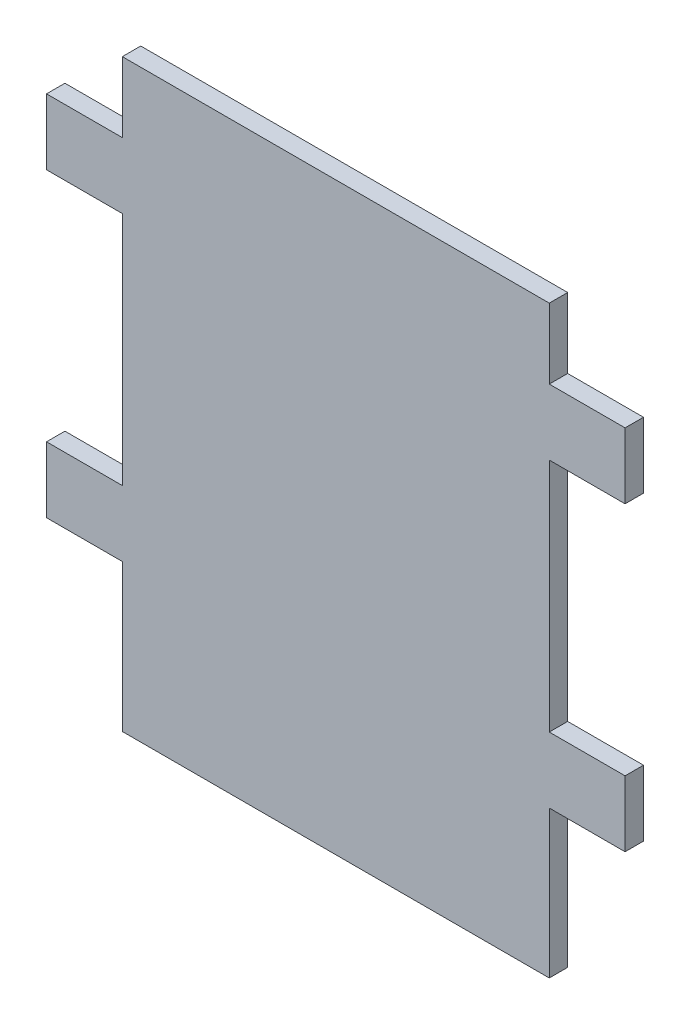
ISO-10303-21;
HEADER;
FILE_DESCRIPTION(('STEP AP214'),'2;1');
FILE_NAME('part.step','',(''),(''),'','','');
FILE_SCHEMA(('AUTOMOTIVE_DESIGN { 1 0 10303 214 1 1 1 1 }'));
ENDSEC;
DATA;
#1=APPLICATION_CONTEXT('core data for automotive mechanical design processes');
#2=APPLICATION_PROTOCOL_DEFINITION('international standard','automotive_design',2000,#1);
#3=PRODUCT_CONTEXT('',#1,'mechanical');
#4=PRODUCT('Part','Part','',(#3));
#5=PRODUCT_RELATED_PRODUCT_CATEGORY('part','',(#4));
#6=PRODUCT_DEFINITION_FORMATION('','',#4);
#7=PRODUCT_DEFINITION_CONTEXT('part definition',#1,'design');
#8=PRODUCT_DEFINITION('design','',#6,#7);
#9=PRODUCT_DEFINITION_SHAPE('','',#8);
#10=(LENGTH_UNIT() NAMED_UNIT(*) SI_UNIT(.MILLI.,.METRE.));
#11=(NAMED_UNIT(*) PLANE_ANGLE_UNIT() SI_UNIT($,.RADIAN.));
#12=(NAMED_UNIT(*) SI_UNIT($,.STERADIAN.) SOLID_ANGLE_UNIT());
#13=UNCERTAINTY_MEASURE_WITH_UNIT(LENGTH_MEASURE(1.E-05),#10,'distance_accuracy_value','');
#14=(GEOMETRIC_REPRESENTATION_CONTEXT(3) GLOBAL_UNCERTAINTY_ASSIGNED_CONTEXT((#13)) GLOBAL_UNIT_ASSIGNED_CONTEXT((#10,
#11,#12)) REPRESENTATION_CONTEXT('',''));
#15=CARTESIAN_POINT('',(0.,0.,0.));
#16=DIRECTION('',(0.,0.,1.));
#17=DIRECTION('',(1.,0.,0.));
#18=AXIS2_PLACEMENT_3D('',#15,#16,#17);
#19=CARTESIAN_POINT('',(-48.6695817036597,65.3946510951075,3.175));
#20=DIRECTION('',(1.,0.,0.));
#21=DIRECTION('',(0.,1.,0.));
#22=AXIS2_PLACEMENT_3D('',#19,#20,#21);
#23=PLANE('',#22);
#24=DIRECTION('',(0.,-1.,0.));
#25=VECTOR('',#24,1.);
#26=CARTESIAN_POINT('',(-48.6695817036597,65.3946510951075,0.));
#27=LINE('',#26,#25);
#28=CARTESIAN_POINT('',(-48.6695817036597,53.2946498951075,0.));
#29=VERTEX_POINT('',#28);
#30=CARTESIAN_POINT('',(-48.6695817036597,41.9446598951075,0.));
#31=VERTEX_POINT('',#30);
#32=EDGE_CURVE('E192',#29,#31,#27,.T.);
#33=ORIENTED_EDGE('',*,*,#32,.T.);
#34=DIRECTION('',(0.,0.,1.));
#35=VECTOR('',#34,1.);
#36=CARTESIAN_POINT('',(-48.6695817036597,41.9446598951075,0.));
#37=LINE('',#36,#35);
#38=CARTESIAN_POINT('',(-48.6695817036597,41.9446598951075,3.175));
#39=VERTEX_POINT('',#38);
#40=EDGE_CURVE('E287',#31,#39,#37,.T.);
#41=ORIENTED_EDGE('',*,*,#40,.T.);
#42=DIRECTION('',(0.,-1.,0.));
#43=VECTOR('',#42,1.);
#44=CARTESIAN_POINT('',(-48.6695817036597,65.3946510951075,3.175));
#45=LINE('',#44,#43);
#46=CARTESIAN_POINT('',(-48.6695817036597,53.2946498951075,3.175));
#47=VERTEX_POINT('',#46);
#48=EDGE_CURVE('E219',#47,#39,#45,.T.);
#49=ORIENTED_EDGE('',*,*,#48,.F.);
#50=DIRECTION('',(0.,0.,1.));
#51=VECTOR('',#50,1.);
#52=CARTESIAN_POINT('',(-48.6695817036597,53.2946498951075,0.));
#53=LINE('',#52,#51);
#54=EDGE_CURVE('E227',#29,#47,#53,.T.);
#55=ORIENTED_EDGE('',*,*,#54,.F.);
#56=EDGE_LOOP('',(#33,#41,#49,#55));
#57=FACE_BOUND('',#56,.T.);
#58=ADVANCED_FACE('F33',(#57),#23,.F.);
#59=CARTESIAN_POINT('',(51.1504370963403,65.3946510951075,3.175));
#60=DIRECTION('',(-1.,0.,0.));
#61=DIRECTION('',(0.,-1.,0.));
#62=AXIS2_PLACEMENT_3D('',#59,#60,#61);
#63=PLANE('',#62);
#64=DIRECTION('',(0.,1.,0.));
#65=VECTOR('',#64,1.);
#66=CARTESIAN_POINT('',(51.1504370963403,65.3946510951075,0.));
#67=LINE('',#66,#65);
#68=CARTESIAN_POINT('',(51.1504370963403,41.9446598951075,0.));
#69=VERTEX_POINT('',#68);
#70=CARTESIAN_POINT('',(51.1504370963403,53.2946498951075,0.));
#71=VERTEX_POINT('',#70);
#72=EDGE_CURVE('E203',#69,#71,#67,.T.);
#73=ORIENTED_EDGE('',*,*,#72,.T.);
#74=DIRECTION('',(0.,0.,1.));
#75=VECTOR('',#74,1.);
#76=CARTESIAN_POINT('',(51.1504370963403,53.2946498951075,0.));
#77=LINE('',#76,#75);
#78=CARTESIAN_POINT('',(51.1504370963403,53.2946498951075,3.175));
#79=VERTEX_POINT('',#78);
#80=EDGE_CURVE('E339',#71,#79,#77,.T.);
#81=ORIENTED_EDGE('',*,*,#80,.T.);
#82=DIRECTION('',(0.,1.,0.));
#83=VECTOR('',#82,1.);
#84=CARTESIAN_POINT('',(51.1504370963403,65.3946510951075,3.175));
#85=LINE('',#84,#83);
#86=CARTESIAN_POINT('',(51.1504370963403,41.9446598951075,3.175));
#87=VERTEX_POINT('',#86);
#88=EDGE_CURVE('E230',#87,#79,#85,.T.);
#89=ORIENTED_EDGE('',*,*,#88,.F.);
#90=DIRECTION('',(0.,0.,1.));
#91=VECTOR('',#90,1.);
#92=CARTESIAN_POINT('',(51.1504370963403,41.9446598951075,0.));
#93=LINE('',#92,#91);
#94=EDGE_CURVE('E252',#69,#87,#93,.T.);
#95=ORIENTED_EDGE('',*,*,#94,.F.);
#96=EDGE_LOOP('',(#73,#81,#89,#95));
#97=FACE_BOUND('',#96,.T.);
#98=ADVANCED_FACE('F359',(#97),#63,.F.);
#99=CARTESIAN_POINT('',(-48.6695817036596,1.30465989510754,3.175));
#100=VERTEX_POINT('',#99);
#101=CARTESIAN_POINT('',(-48.6695817036597,-10.0453301048925,3.175));
#102=VERTEX_POINT('',#101);
#103=EDGE_CURVE('E187',#100,#102,#45,.T.);
#104=ORIENTED_EDGE('',*,*,#103,.F.);
#105=DIRECTION('',(0.,0.,1.));
#106=VECTOR('',#105,1.);
#107=CARTESIAN_POINT('',(-48.6695817036596,1.30465989510754,0.));
#108=LINE('',#107,#106);
#109=CARTESIAN_POINT('',(-48.6695817036596,1.30465989510754,0.));
#110=VERTEX_POINT('',#109);
#111=EDGE_CURVE('E174',#110,#100,#108,.T.);
#112=ORIENTED_EDGE('',*,*,#111,.F.);
#113=CARTESIAN_POINT('',(-48.6695817036597,-10.0453301048925,0.));
#114=VERTEX_POINT('',#113);
#115=EDGE_CURVE('E185',#110,#114,#27,.T.);
#116=ORIENTED_EDGE('',*,*,#115,.T.);
#117=DIRECTION('',(0.,0.,1.));
#118=VECTOR('',#117,1.);
#119=CARTESIAN_POINT('',(-48.6695817036597,-10.0453301048925,0.));
#120=LINE('',#119,#118);
#121=EDGE_CURVE('E320',#114,#102,#120,.T.);
#122=ORIENTED_EDGE('',*,*,#121,.T.);
#123=EDGE_LOOP('',(#104,#112,#116,#122));
#124=FACE_BOUND('',#123,.T.);
#125=ADVANCED_FACE('F35',(#124),#23,.F.);
#126=CARTESIAN_POINT('',(-48.6695817036596,-35.4453301048925,3.175));
#127=DIRECTION('',(0.,1.,0.));
#128=DIRECTION('',(0.,0.,1.));
#129=AXIS2_PLACEMENT_3D('',#126,#127,#128);
#130=PLANE('',#129);
#131=DIRECTION('',(1.,0.,0.));
#132=VECTOR('',#131,1.);
#133=CARTESIAN_POINT('',(-48.6695817036596,-35.4453301048925,3.175));
#134=LINE('',#133,#132);
#135=CARTESIAN_POINT('',(-35.5895723036597,-35.4453301048925,3.175));
#136=VERTEX_POINT('',#135);
#137=CARTESIAN_POINT('',(38.0704276963403,-35.4453301048925,3.175));
#138=VERTEX_POINT('',#137);
#139=EDGE_CURVE('E224',#136,#138,#134,.T.);
#140=ORIENTED_EDGE('',*,*,#139,.F.);
#141=DIRECTION('',(0.,0.,1.));
#142=VECTOR('',#141,1.);
#143=CARTESIAN_POINT('',(-35.5895723036597,-35.4453301048925,0.));
#144=LINE('',#143,#142);
#145=CARTESIAN_POINT('',(-35.5895723036597,-35.4453301048925,0.));
#146=VERTEX_POINT('',#145);
#147=EDGE_CURVE('E314',#146,#136,#144,.T.);
#148=ORIENTED_EDGE('',*,*,#147,.F.);
#149=DIRECTION('',(1.,0.,0.));
#150=VECTOR('',#149,1.);
#151=CARTESIAN_POINT('',(-48.6695817036596,-35.4453301048925,0.));
#152=LINE('',#151,#150);
#153=CARTESIAN_POINT('',(38.0704276963403,-35.4453301048925,0.));
#154=VERTEX_POINT('',#153);
#155=EDGE_CURVE('E196',#146,#154,#152,.T.);
#156=ORIENTED_EDGE('',*,*,#155,.T.);
#157=DIRECTION('',(0.,0.,1.));
#158=VECTOR('',#157,1.);
#159=CARTESIAN_POINT('',(38.0704276963403,-35.4453301048925,0.));
#160=LINE('',#159,#158);
#161=EDGE_CURVE('E267',#154,#138,#160,.T.);
#162=ORIENTED_EDGE('',*,*,#161,.T.);
#163=EDGE_LOOP('',(#140,#148,#156,#162));
#164=FACE_BOUND('',#163,.T.);
#165=ADVANCED_FACE('F392',(#164),#130,.F.);
#166=CARTESIAN_POINT('',(51.1504370963403,-10.0453301048925,0.));
#167=VERTEX_POINT('',#166);
#168=CARTESIAN_POINT('',(51.1504370963403,1.30465989510757,0.));
#169=VERTEX_POINT('',#168);
#170=EDGE_CURVE('E205',#167,#169,#67,.T.);
#171=ORIENTED_EDGE('',*,*,#170,.T.);
#172=DIRECTION('',(0.,0.,1.));
#173=VECTOR('',#172,1.);
#174=CARTESIAN_POINT('',(51.1504370963404,1.30465989510754,0.));
#175=LINE('',#174,#173);
#176=CARTESIAN_POINT('',(51.1504370963404,1.30465989510754,3.175));
#177=VERTEX_POINT('',#176);
#178=EDGE_CURVE('E248',#169,#177,#175,.T.);
#179=ORIENTED_EDGE('',*,*,#178,.T.);
#180=CARTESIAN_POINT('',(51.1504370963403,-10.0453301048925,3.175));
#181=VERTEX_POINT('',#180);
#182=EDGE_CURVE('E42',#181,#177,#85,.T.);
#183=ORIENTED_EDGE('',*,*,#182,.F.);
#184=DIRECTION('',(0.,0.,1.));
#185=VECTOR('',#184,1.);
#186=CARTESIAN_POINT('',(51.1504370963403,-10.0453301048925,0.));
#187=LINE('',#186,#185);
#188=EDGE_CURVE('E247',#167,#181,#187,.T.);
#189=ORIENTED_EDGE('',*,*,#188,.F.);
#190=EDGE_LOOP('',(#171,#179,#183,#189));
#191=FACE_BOUND('',#190,.T.);
#192=ADVANCED_FACE('F246',(#191),#63,.F.);
#193=CARTESIAN_POINT('',(-48.6695817036597,65.3946510951075,3.175));
#194=DIRECTION('',(0.,-1.,0.));
#195=DIRECTION('',(0.,0.,-1.));
#196=AXIS2_PLACEMENT_3D('',#193,#194,#195);
#197=PLANE('',#196);
#198=DIRECTION('',(-1.,0.,0.));
#199=VECTOR('',#198,1.);
#200=CARTESIAN_POINT('',(-48.6695817036597,65.3946510951075,3.175));
#201=LINE('',#200,#199);
#202=CARTESIAN_POINT('',(38.0704276963403,65.3946510951075,3.175));
#203=VERTEX_POINT('',#202);
#204=CARTESIAN_POINT('',(-35.5895723036597,65.3946510951075,3.175));
#205=VERTEX_POINT('',#204);
#206=EDGE_CURVE('E11',#203,#205,#201,.T.);
#207=ORIENTED_EDGE('',*,*,#206,.F.);
#208=DIRECTION('',(0.,0.,1.));
#209=VECTOR('',#208,1.);
#210=CARTESIAN_POINT('',(38.0704276963403,65.3946510951075,0.));
#211=LINE('',#210,#209);
#212=CARTESIAN_POINT('',(38.0704276963403,65.3946510951075,0.));
#213=VERTEX_POINT('',#212);
#214=EDGE_CURVE('E318',#213,#203,#211,.T.);
#215=ORIENTED_EDGE('',*,*,#214,.F.);
#216=DIRECTION('',(-1.,0.,0.));
#217=VECTOR('',#216,1.);
#218=CARTESIAN_POINT('',(-48.6695817036597,65.3946510951075,0.));
#219=LINE('',#218,#217);
#220=CARTESIAN_POINT('',(-35.5895723036597,65.3946510951075,0.));
#221=VERTEX_POINT('',#220);
#222=EDGE_CURVE('E37',#213,#221,#219,.T.);
#223=ORIENTED_EDGE('',*,*,#222,.T.);
#224=DIRECTION('',(0.,0.,1.));
#225=VECTOR('',#224,1.);
#226=CARTESIAN_POINT('',(-35.5895723036597,65.3946510951075,0.));
#227=LINE('',#226,#225);
#228=EDGE_CURVE('E193',#221,#205,#227,.T.);
#229=ORIENTED_EDGE('',*,*,#228,.T.);
#230=EDGE_LOOP('',(#207,#215,#223,#229));
#231=FACE_BOUND('',#230,.T.);
#232=ADVANCED_FACE('F367',(#231),#197,.F.);
#233=CARTESIAN_POINT('',(0.,0.,3.175));
#234=DIRECTION('',(0.,0.,1.));
#235=DIRECTION('',(1.,0.,0.));
#236=AXIS2_PLACEMENT_3D('',#233,#234,#235);
#237=PLANE('',#236);
#238=DIRECTION('',(-1.,0.,0.));
#239=VECTOR('',#238,1.);
#240=CARTESIAN_POINT('',(-48.6695817036597,41.9446598951075,3.175));
#241=LINE('',#240,#239);
#242=CARTESIAN_POINT('',(-35.5895723036597,41.9446598951075,3.175));
#243=VERTEX_POINT('',#242);
#244=EDGE_CURVE('E179',#243,#39,#241,.T.);
#245=ORIENTED_EDGE('',*,*,#244,.F.);
#246=DIRECTION('',(0.,1.,0.));
#247=VECTOR('',#246,1.);
#248=CARTESIAN_POINT('',(-35.5895723036597,41.9446598951075,3.175));
#249=LINE('',#248,#247);
#250=CARTESIAN_POINT('',(-35.5895723036597,1.30465989510754,3.175));
#251=VERTEX_POINT('',#250);
#252=EDGE_CURVE('E372',#251,#243,#249,.T.);
#253=ORIENTED_EDGE('',*,*,#252,.F.);
#254=DIRECTION('',(1.,0.,0.));
#255=VECTOR('',#254,1.);
#256=CARTESIAN_POINT('',(-48.6695817036596,1.30465989510754,3.175));
#257=LINE('',#256,#255);
#258=EDGE_CURVE('E322',#100,#251,#257,.T.);
#259=ORIENTED_EDGE('',*,*,#258,.F.);
#260=ORIENTED_EDGE('',*,*,#103,.T.);
#261=DIRECTION('',(-1.,0.,0.));
#262=VECTOR('',#261,1.);
#263=CARTESIAN_POINT('',(-48.6695817036597,-10.0453301048925,3.175));
#264=LINE('',#263,#262);
#265=CARTESIAN_POINT('',(-35.5895723036597,-10.0453301048925,3.175));
#266=VERTEX_POINT('',#265);
#267=EDGE_CURVE('E312',#266,#102,#264,.T.);
#268=ORIENTED_EDGE('',*,*,#267,.F.);
#269=DIRECTION('',(0.,1.,0.));
#270=VECTOR('',#269,1.);
#271=CARTESIAN_POINT('',(-35.5895723036597,-35.4453301048925,3.175));
#272=LINE('',#271,#270);
#273=EDGE_CURVE('E315',#136,#266,#272,.T.);
#274=ORIENTED_EDGE('',*,*,#273,.F.);
#275=ORIENTED_EDGE('',*,*,#139,.T.);
#276=DIRECTION('',(0.,-1.,0.));
#277=VECTOR('',#276,1.);
#278=CARTESIAN_POINT('',(38.0704276963403,-35.4453301048925,3.175));
#279=LINE('',#278,#277);
#280=CARTESIAN_POINT('',(38.0704276963403,-10.0453301048925,3.175));
#281=VERTEX_POINT('',#280);
#282=EDGE_CURVE('E268',#281,#138,#279,.T.);
#283=ORIENTED_EDGE('',*,*,#282,.F.);
#284=DIRECTION('',(-1.,0.,0.));
#285=VECTOR('',#284,1.);
#286=CARTESIAN_POINT('',(38.0704276963403,-10.0453301048925,3.175));
#287=LINE('',#286,#285);
#288=EDGE_CURVE('E245',#181,#281,#287,.T.);
#289=ORIENTED_EDGE('',*,*,#288,.F.);
#290=ORIENTED_EDGE('',*,*,#182,.T.);
#291=DIRECTION('',(1.,0.,0.));
#292=VECTOR('',#291,1.);
#293=CARTESIAN_POINT('',(38.0704276963403,1.30465989510754,3.175));
#294=LINE('',#293,#292);
#295=CARTESIAN_POINT('',(38.0704276963403,1.30465989510754,3.175));
#296=VERTEX_POINT('',#295);
#297=EDGE_CURVE('E242',#296,#177,#294,.T.);
#298=ORIENTED_EDGE('',*,*,#297,.F.);
#299=DIRECTION('',(0.,-1.,0.));
#300=VECTOR('',#299,1.);
#301=CARTESIAN_POINT('',(38.0704276963403,41.9446598951075,3.175));
#302=LINE('',#301,#300);
#303=CARTESIAN_POINT('',(38.0704276963403,41.9446598951075,3.175));
#304=VERTEX_POINT('',#303);
#305=EDGE_CURVE('E273',#304,#296,#302,.T.);
#306=ORIENTED_EDGE('',*,*,#305,.F.);
#307=DIRECTION('',(-1.,0.,0.));
#308=VECTOR('',#307,1.);
#309=CARTESIAN_POINT('',(38.0704276963403,41.9446598951075,3.175));
#310=LINE('',#309,#308);
#311=EDGE_CURVE('E346',#87,#304,#310,.T.);
#312=ORIENTED_EDGE('',*,*,#311,.F.);
#313=ORIENTED_EDGE('',*,*,#88,.T.);
#314=DIRECTION('',(1.,0.,0.));
#315=VECTOR('',#314,1.);
#316=CARTESIAN_POINT('',(38.0704276963403,53.2946498951075,3.175));
#317=LINE('',#316,#315);
#318=CARTESIAN_POINT('',(38.0704276963403,53.2946498951075,3.175));
#319=VERTEX_POINT('',#318);
#320=EDGE_CURVE('E330',#319,#79,#317,.T.);
#321=ORIENTED_EDGE('',*,*,#320,.F.);
#322=DIRECTION('',(0.,-1.,0.));
#323=VECTOR('',#322,1.);
#324=CARTESIAN_POINT('',(38.0704276963403,65.3946510951075,3.175));
#325=LINE('',#324,#323);
#326=EDGE_CURVE('E334',#203,#319,#325,.T.);
#327=ORIENTED_EDGE('',*,*,#326,.F.);
#328=ORIENTED_EDGE('',*,*,#206,.T.);
#329=DIRECTION('',(0.,1.,0.));
#330=VECTOR('',#329,1.);
#331=CARTESIAN_POINT('',(-35.5895723036597,65.3946510951075,3.175));
#332=LINE('',#331,#330);
#333=CARTESIAN_POINT('',(-35.5895723036597,53.2946498951075,3.175));
#334=VERTEX_POINT('',#333);
#335=EDGE_CURVE('E281',#334,#205,#332,.T.);
#336=ORIENTED_EDGE('',*,*,#335,.F.);
#337=DIRECTION('',(1.,0.,0.));
#338=VECTOR('',#337,1.);
#339=CARTESIAN_POINT('',(-48.6695817036597,53.2946498951075,3.175));
#340=LINE('',#339,#338);
#341=EDGE_CURVE('E284',#47,#334,#340,.T.);
#342=ORIENTED_EDGE('',*,*,#341,.F.);
#343=ORIENTED_EDGE('',*,*,#48,.T.);
#344=EDGE_LOOP('',(#245,#253,#259,#260,#268,#274,#275,#283,#289,#290,#298,#306,#312,#313,#321,
#327,#328,#336,#342,#343));
#345=FACE_BOUND('',#344,.T.);
#346=ADVANCED_FACE('F240',(#345),#237,.T.);
#347=CARTESIAN_POINT('',(0.,0.,0.));
#348=DIRECTION('',(0.,0.,1.));
#349=DIRECTION('',(1.,0.,0.));
#350=AXIS2_PLACEMENT_3D('',#347,#348,#349);
#351=PLANE('',#350);
#352=DIRECTION('',(0.,1.,0.));
#353=VECTOR('',#352,1.);
#354=CARTESIAN_POINT('',(-35.5895723036597,41.9446598951075,0.));
#355=LINE('',#354,#353);
#356=CARTESIAN_POINT('',(-35.5895723036597,1.30465989510754,0.));
#357=VERTEX_POINT('',#356);
#358=CARTESIAN_POINT('',(-35.5895723036597,41.9446598951075,0.));
#359=VERTEX_POINT('',#358);
#360=EDGE_CURVE('E50',#357,#359,#355,.T.);
#361=ORIENTED_EDGE('',*,*,#360,.T.);
#362=DIRECTION('',(-1.,0.,0.));
#363=VECTOR('',#362,1.);
#364=CARTESIAN_POINT('',(-48.6695817036597,41.9446598951075,0.));
#365=LINE('',#364,#363);
#366=EDGE_CURVE('E188',#359,#31,#365,.T.);
#367=ORIENTED_EDGE('',*,*,#366,.T.);
#368=ORIENTED_EDGE('',*,*,#32,.F.);
#369=DIRECTION('',(1.,0.,0.));
#370=VECTOR('',#369,1.);
#371=CARTESIAN_POINT('',(-48.6695817036597,53.2946498951075,0.));
#372=LINE('',#371,#370);
#373=CARTESIAN_POINT('',(-35.5895723036597,53.2946498951075,0.));
#374=VERTEX_POINT('',#373);
#375=EDGE_CURVE('E277',#29,#374,#372,.T.);
#376=ORIENTED_EDGE('',*,*,#375,.T.);
#377=DIRECTION('',(0.,1.,0.));
#378=VECTOR('',#377,1.);
#379=CARTESIAN_POINT('',(-35.5895723036597,65.3946510951075,0.));
#380=LINE('',#379,#378);
#381=EDGE_CURVE('E280',#374,#221,#380,.T.);
#382=ORIENTED_EDGE('',*,*,#381,.T.);
#383=ORIENTED_EDGE('',*,*,#222,.F.);
#384=DIRECTION('',(0.,-1.,0.));
#385=VECTOR('',#384,1.);
#386=CARTESIAN_POINT('',(38.0704276963403,65.3946510951075,0.));
#387=LINE('',#386,#385);
#388=CARTESIAN_POINT('',(38.0704276963403,53.2946498951075,0.));
#389=VERTEX_POINT('',#388);
#390=EDGE_CURVE('E326',#213,#389,#387,.T.);
#391=ORIENTED_EDGE('',*,*,#390,.T.);
#392=DIRECTION('',(1.,0.,0.));
#393=VECTOR('',#392,1.);
#394=CARTESIAN_POINT('',(38.0704276963403,53.2946498951075,0.));
#395=LINE('',#394,#393);
#396=EDGE_CURVE('E329',#389,#71,#395,.T.);
#397=ORIENTED_EDGE('',*,*,#396,.T.);
#398=ORIENTED_EDGE('',*,*,#72,.F.);
#399=DIRECTION('',(-1.,0.,0.));
#400=VECTOR('',#399,1.);
#401=CARTESIAN_POINT('',(38.0704276963403,41.9446598951075,0.));
#402=LINE('',#401,#400);
#403=CARTESIAN_POINT('',(38.0704276963403,41.9446598951075,0.));
#404=VERTEX_POINT('',#403);
#405=EDGE_CURVE('E257',#69,#404,#402,.T.);
#406=ORIENTED_EDGE('',*,*,#405,.T.);
#407=DIRECTION('',(0.,-1.,0.));
#408=VECTOR('',#407,1.);
#409=CARTESIAN_POINT('',(38.0704276963403,41.9446598951075,0.));
#410=LINE('',#409,#408);
#411=CARTESIAN_POINT('',(38.0704276963403,1.30465989510754,0.));
#412=VERTEX_POINT('',#411);
#413=EDGE_CURVE('E342',#404,#412,#410,.T.);
#414=ORIENTED_EDGE('',*,*,#413,.T.);
#415=DIRECTION('',(1.,0.,0.));
#416=VECTOR('',#415,1.);
#417=CARTESIAN_POINT('',(38.0704276963403,1.30465989510754,0.));
#418=LINE('',#417,#416);
#419=EDGE_CURVE('E345',#412,#169,#418,.T.);
#420=ORIENTED_EDGE('',*,*,#419,.T.);
#421=ORIENTED_EDGE('',*,*,#170,.F.);
#422=DIRECTION('',(-1.,0.,0.));
#423=VECTOR('',#422,1.);
#424=CARTESIAN_POINT('',(38.0704276963403,-10.0453301048925,0.));
#425=LINE('',#424,#423);
#426=CARTESIAN_POINT('',(38.0704276963403,-10.0453301048925,0.));
#427=VERTEX_POINT('',#426);
#428=EDGE_CURVE('E264',#167,#427,#425,.T.);
#429=ORIENTED_EDGE('',*,*,#428,.T.);
#430=DIRECTION('',(0.,-1.,0.));
#431=VECTOR('',#430,1.);
#432=CARTESIAN_POINT('',(38.0704276963403,-35.4453301048925,0.));
#433=LINE('',#432,#431);
#434=EDGE_CURVE('E261',#427,#154,#433,.T.);
#435=ORIENTED_EDGE('',*,*,#434,.T.);
#436=ORIENTED_EDGE('',*,*,#155,.F.);
#437=DIRECTION('',(0.,1.,0.));
#438=VECTOR('',#437,1.);
#439=CARTESIAN_POINT('',(-35.5895723036597,-35.4453301048925,0.));
#440=LINE('',#439,#438);
#441=CARTESIAN_POINT('',(-35.5895723036597,-10.0453301048925,0.));
#442=VERTEX_POINT('',#441);
#443=EDGE_CURVE('E310',#146,#442,#440,.T.);
#444=ORIENTED_EDGE('',*,*,#443,.T.);
#445=DIRECTION('',(-1.,0.,0.));
#446=VECTOR('',#445,1.);
#447=CARTESIAN_POINT('',(-48.6695817036597,-10.0453301048925,0.));
#448=LINE('',#447,#446);
#449=EDGE_CURVE('E58',#442,#114,#448,.T.);
#450=ORIENTED_EDGE('',*,*,#449,.T.);
#451=ORIENTED_EDGE('',*,*,#115,.F.);
#452=DIRECTION('',(1.,0.,0.));
#453=VECTOR('',#452,1.);
#454=CARTESIAN_POINT('',(-48.6695817036596,1.30465989510754,0.));
#455=LINE('',#454,#453);
#456=EDGE_CURVE('E170',#110,#357,#455,.T.);
#457=ORIENTED_EDGE('',*,*,#456,.T.);
#458=EDGE_LOOP('',(#361,#367,#368,#376,#382,#383,#391,#397,#398,#406,#414,#420,#421,#429,#435,
#436,#444,#450,#451,#457));
#459=FACE_BOUND('',#458,.T.);
#460=ADVANCED_FACE('F190',(#459),#351,.F.);
#461=CARTESIAN_POINT('',(-35.5895723036597,65.3946510951075,0.));
#462=DIRECTION('',(1.,0.,0.));
#463=DIRECTION('',(0.,0.,-1.));
#464=AXIS2_PLACEMENT_3D('',#461,#462,#463);
#465=PLANE('',#464);
#466=ORIENTED_EDGE('',*,*,#335,.T.);
#467=ORIENTED_EDGE('',*,*,#228,.F.);
#468=ORIENTED_EDGE('',*,*,#381,.F.);
#469=DIRECTION('',(0.,0.,1.));
#470=VECTOR('',#469,1.);
#471=CARTESIAN_POINT('',(-35.5895723036597,53.2946498951075,0.));
#472=LINE('',#471,#470);
#473=EDGE_CURVE('E198',#374,#334,#472,.T.);
#474=ORIENTED_EDGE('',*,*,#473,.T.);
#475=EDGE_LOOP('',(#466,#467,#468,#474));
#476=FACE_BOUND('',#475,.T.);
#477=ADVANCED_FACE('F368',(#476),#465,.F.);
#478=CARTESIAN_POINT('',(-48.6695817036597,53.2946498951075,0.));
#479=DIRECTION('',(0.,-1.,0.));
#480=DIRECTION('',(0.,0.,-1.));
#481=AXIS2_PLACEMENT_3D('',#478,#479,#480);
#482=PLANE('',#481);
#483=ORIENTED_EDGE('',*,*,#341,.T.);
#484=ORIENTED_EDGE('',*,*,#473,.F.);
#485=ORIENTED_EDGE('',*,*,#375,.F.);
#486=ORIENTED_EDGE('',*,*,#54,.T.);
#487=EDGE_LOOP('',(#483,#484,#485,#486));
#488=FACE_BOUND('',#487,.T.);
#489=ADVANCED_FACE('F294',(#488),#482,.F.);
#490=CARTESIAN_POINT('',(38.0704276963403,-35.4453301048925,0.));
#491=DIRECTION('',(-1.,0.,0.));
#492=DIRECTION('',(0.,0.,1.));
#493=AXIS2_PLACEMENT_3D('',#490,#491,#492);
#494=PLANE('',#493);
#495=ORIENTED_EDGE('',*,*,#282,.T.);
#496=ORIENTED_EDGE('',*,*,#161,.F.);
#497=ORIENTED_EDGE('',*,*,#434,.F.);
#498=DIRECTION('',(0.,0.,1.));
#499=VECTOR('',#498,1.);
#500=CARTESIAN_POINT('',(38.0704276963403,-10.0453301048925,0.));
#501=LINE('',#500,#499);
#502=EDGE_CURVE('E271',#427,#281,#501,.T.);
#503=ORIENTED_EDGE('',*,*,#502,.T.);
#504=EDGE_LOOP('',(#495,#496,#497,#503));
#505=FACE_BOUND('',#504,.T.);
#506=ADVANCED_FACE('F410',(#505),#494,.F.);
#507=CARTESIAN_POINT('',(38.0704276963403,-10.0453301048925,0.));
#508=DIRECTION('',(0.,1.,0.));
#509=DIRECTION('',(0.,0.,1.));
#510=AXIS2_PLACEMENT_3D('',#507,#508,#509);
#511=PLANE('',#510);
#512=ORIENTED_EDGE('',*,*,#288,.T.);
#513=ORIENTED_EDGE('',*,*,#502,.F.);
#514=ORIENTED_EDGE('',*,*,#428,.F.);
#515=ORIENTED_EDGE('',*,*,#188,.T.);
#516=EDGE_LOOP('',(#512,#513,#514,#515));
#517=FACE_BOUND('',#516,.T.);
#518=ADVANCED_FACE('F415',(#517),#511,.F.);
#519=CARTESIAN_POINT('',(38.0704276963403,41.9446598951075,0.));
#520=DIRECTION('',(-1.,0.,0.));
#521=DIRECTION('',(0.,0.,1.));
#522=AXIS2_PLACEMENT_3D('',#519,#520,#521);
#523=PLANE('',#522);
#524=ORIENTED_EDGE('',*,*,#305,.T.);
#525=DIRECTION('',(0.,0.,1.));
#526=VECTOR('',#525,1.);
#527=CARTESIAN_POINT('',(38.0704276963403,1.30465989510754,0.));
#528=LINE('',#527,#526);
#529=EDGE_CURVE('E253',#412,#296,#528,.T.);
#530=ORIENTED_EDGE('',*,*,#529,.F.);
#531=ORIENTED_EDGE('',*,*,#413,.F.);
#532=DIRECTION('',(0.,0.,1.));
#533=VECTOR('',#532,1.);
#534=CARTESIAN_POINT('',(38.0704276963403,41.9446598951075,0.));
#535=LINE('',#534,#533);
#536=EDGE_CURVE('E255',#404,#304,#535,.T.);
#537=ORIENTED_EDGE('',*,*,#536,.T.);
#538=EDGE_LOOP('',(#524,#530,#531,#537));
#539=FACE_BOUND('',#538,.T.);
#540=ADVANCED_FACE('F356',(#539),#523,.F.);
#541=CARTESIAN_POINT('',(38.0704276963403,41.9446598951075,0.));
#542=DIRECTION('',(0.,1.,0.));
#543=DIRECTION('',(0.,0.,1.));
#544=AXIS2_PLACEMENT_3D('',#541,#542,#543);
#545=PLANE('',#544);
#546=ORIENTED_EDGE('',*,*,#311,.T.);
#547=ORIENTED_EDGE('',*,*,#536,.F.);
#548=ORIENTED_EDGE('',*,*,#405,.F.);
#549=ORIENTED_EDGE('',*,*,#94,.T.);
#550=EDGE_LOOP('',(#546,#547,#548,#549));
#551=FACE_BOUND('',#550,.T.);
#552=ADVANCED_FACE('F358',(#551),#545,.F.);
#553=CARTESIAN_POINT('',(38.0704276963403,1.30465989510754,0.));
#554=DIRECTION('',(0.,-1.,0.));
#555=DIRECTION('',(0.,0.,-1.));
#556=AXIS2_PLACEMENT_3D('',#553,#554,#555);
#557=PLANE('',#556);
#558=ORIENTED_EDGE('',*,*,#297,.T.);
#559=ORIENTED_EDGE('',*,*,#178,.F.);
#560=ORIENTED_EDGE('',*,*,#419,.F.);
#561=ORIENTED_EDGE('',*,*,#529,.T.);
#562=EDGE_LOOP('',(#558,#559,#560,#561));
#563=FACE_BOUND('',#562,.T.);
#564=ADVANCED_FACE('F422',(#563),#557,.F.);
#565=CARTESIAN_POINT('',(38.0704276963403,65.3946510951075,0.));
#566=DIRECTION('',(-1.,0.,0.));
#567=DIRECTION('',(0.,0.,1.));
#568=AXIS2_PLACEMENT_3D('',#565,#566,#567);
#569=PLANE('',#568);
#570=ORIENTED_EDGE('',*,*,#326,.T.);
#571=DIRECTION('',(0.,0.,1.));
#572=VECTOR('',#571,1.);
#573=CARTESIAN_POINT('',(38.0704276963403,53.2946498951075,0.));
#574=LINE('',#573,#572);
#575=EDGE_CURVE('E333',#389,#319,#574,.T.);
#576=ORIENTED_EDGE('',*,*,#575,.F.);
#577=ORIENTED_EDGE('',*,*,#390,.F.);
#578=ORIENTED_EDGE('',*,*,#214,.T.);
#579=EDGE_LOOP('',(#570,#576,#577,#578));
#580=FACE_BOUND('',#579,.T.);
#581=ADVANCED_FACE('F364',(#580),#569,.F.);
#582=CARTESIAN_POINT('',(38.0704276963403,53.2946498951075,0.));
#583=DIRECTION('',(0.,-1.,0.));
#584=DIRECTION('',(0.,0.,-1.));
#585=AXIS2_PLACEMENT_3D('',#582,#583,#584);
#586=PLANE('',#585);
#587=ORIENTED_EDGE('',*,*,#320,.T.);
#588=ORIENTED_EDGE('',*,*,#80,.F.);
#589=ORIENTED_EDGE('',*,*,#396,.F.);
#590=ORIENTED_EDGE('',*,*,#575,.T.);
#591=EDGE_LOOP('',(#587,#588,#589,#590));
#592=FACE_BOUND('',#591,.T.);
#593=ADVANCED_FACE('F362',(#592),#586,.F.);
#594=CARTESIAN_POINT('',(-48.6695817036597,-10.0453301048925,0.));
#595=DIRECTION('',(0.,1.,0.));
#596=DIRECTION('',(0.,0.,1.));
#597=AXIS2_PLACEMENT_3D('',#594,#595,#596);
#598=PLANE('',#597);
#599=ORIENTED_EDGE('',*,*,#267,.T.);
#600=ORIENTED_EDGE('',*,*,#121,.F.);
#601=ORIENTED_EDGE('',*,*,#449,.F.);
#602=DIRECTION('',(0.,0.,1.));
#603=VECTOR('',#602,1.);
#604=CARTESIAN_POINT('',(-35.5895723036597,-10.0453301048925,0.));
#605=LINE('',#604,#603);
#606=EDGE_CURVE('E323',#442,#266,#605,.T.);
#607=ORIENTED_EDGE('',*,*,#606,.T.);
#608=EDGE_LOOP('',(#599,#600,#601,#607));
#609=FACE_BOUND('',#608,.T.);
#610=ADVANCED_FACE('F431',(#609),#598,.F.);
#611=CARTESIAN_POINT('',(-35.5895723036597,-35.4453301048925,0.));
#612=DIRECTION('',(1.,0.,0.));
#613=DIRECTION('',(0.,0.,-1.));
#614=AXIS2_PLACEMENT_3D('',#611,#612,#613);
#615=PLANE('',#614);
#616=ORIENTED_EDGE('',*,*,#273,.T.);
#617=ORIENTED_EDGE('',*,*,#606,.F.);
#618=ORIENTED_EDGE('',*,*,#443,.F.);
#619=ORIENTED_EDGE('',*,*,#147,.T.);
#620=EDGE_LOOP('',(#616,#617,#618,#619));
#621=FACE_BOUND('',#620,.T.);
#622=ADVANCED_FACE('F384',(#621),#615,.F.);
#623=CARTESIAN_POINT('',(-48.6695817036597,41.9446598951075,0.));
#624=DIRECTION('',(0.,1.,0.));
#625=DIRECTION('',(0.,0.,1.));
#626=AXIS2_PLACEMENT_3D('',#623,#624,#625);
#627=PLANE('',#626);
#628=ORIENTED_EDGE('',*,*,#244,.T.);
#629=ORIENTED_EDGE('',*,*,#40,.F.);
#630=ORIENTED_EDGE('',*,*,#366,.F.);
#631=DIRECTION('',(0.,0.,1.));
#632=VECTOR('',#631,1.);
#633=CARTESIAN_POINT('',(-35.5895723036597,41.9446598951075,0.));
#634=LINE('',#633,#632);
#635=EDGE_CURVE('E303',#359,#243,#634,.T.);
#636=ORIENTED_EDGE('',*,*,#635,.T.);
#637=EDGE_LOOP('',(#628,#629,#630,#636));
#638=FACE_BOUND('',#637,.T.);
#639=ADVANCED_FACE('F375',(#638),#627,.F.);
#640=CARTESIAN_POINT('',(-35.5895723036597,41.9446598951075,0.));
#641=DIRECTION('',(1.,0.,0.));
#642=DIRECTION('',(0.,0.,-1.));
#643=AXIS2_PLACEMENT_3D('',#640,#641,#642);
#644=PLANE('',#643);
#645=ORIENTED_EDGE('',*,*,#252,.T.);
#646=ORIENTED_EDGE('',*,*,#635,.F.);
#647=ORIENTED_EDGE('',*,*,#360,.F.);
#648=DIRECTION('',(0.,0.,1.));
#649=VECTOR('',#648,1.);
#650=CARTESIAN_POINT('',(-35.5895723036597,1.30465989510754,0.));
#651=LINE('',#650,#649);
#652=EDGE_CURVE('E176',#357,#251,#651,.T.);
#653=ORIENTED_EDGE('',*,*,#652,.T.);
#654=EDGE_LOOP('',(#645,#646,#647,#653));
#655=FACE_BOUND('',#654,.T.);
#656=ADVANCED_FACE('F376',(#655),#644,.F.);
#657=CARTESIAN_POINT('',(-48.6695817036596,1.30465989510754,0.));
#658=DIRECTION('',(0.,-1.,0.));
#659=DIRECTION('',(0.,0.,-1.));
#660=AXIS2_PLACEMENT_3D('',#657,#658,#659);
#661=PLANE('',#660);
#662=ORIENTED_EDGE('',*,*,#258,.T.);
#663=ORIENTED_EDGE('',*,*,#652,.F.);
#664=ORIENTED_EDGE('',*,*,#456,.F.);
#665=ORIENTED_EDGE('',*,*,#111,.T.);
#666=EDGE_LOOP('',(#662,#663,#664,#665));
#667=FACE_BOUND('',#666,.T.);
#668=ADVANCED_FACE('F173',(#667),#661,.F.);
#669=CLOSED_SHELL('',(#58,#98,#125,#165,#192,#232,#346,#460,#477,#489,#506,#518,#540,#552,#564,
#581,#593,#610,#622,#639,#656,#668));
#670=MANIFOLD_SOLID_BREP('B2',#669);
#671=ADVANCED_BREP_SHAPE_REPRESENTATION('',(#18,#670),#14);
#672=SHAPE_DEFINITION_REPRESENTATION(#9,#671);
ENDSEC;
END-ISO-10303-21;
